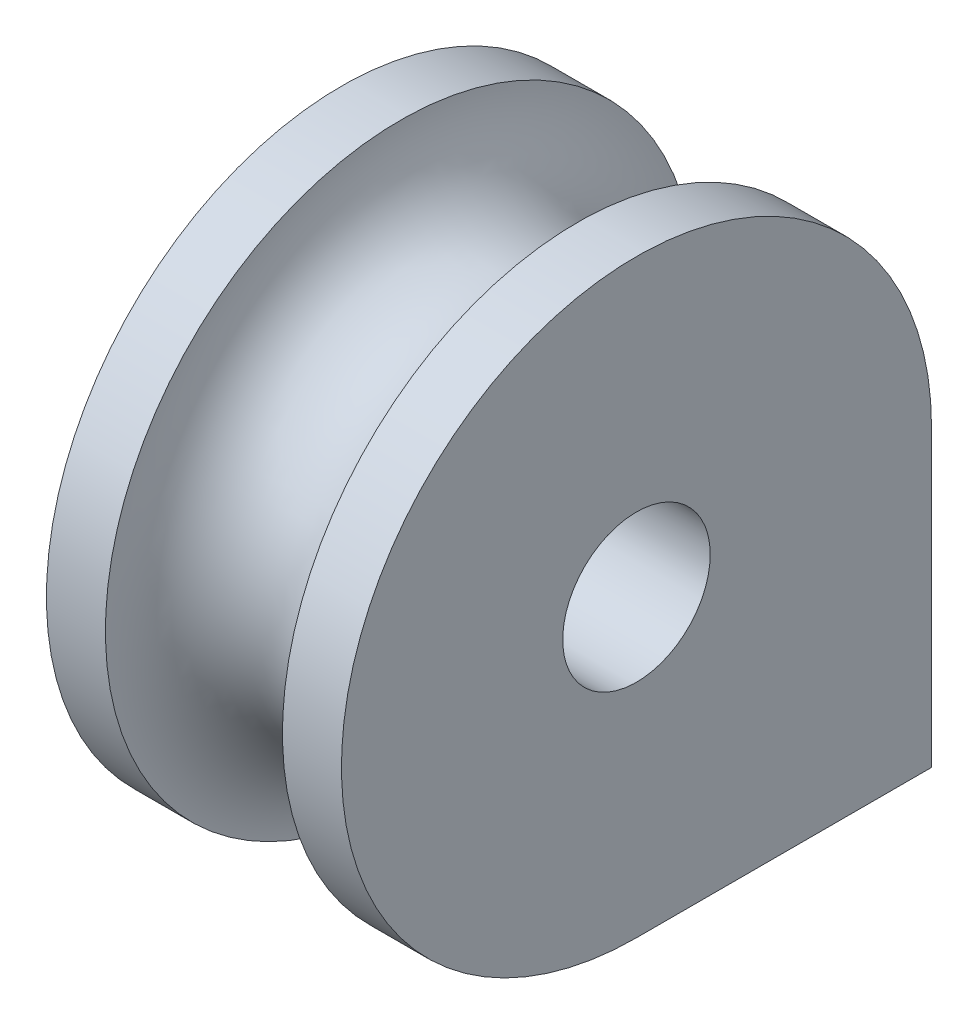
ISO-10303-21;
HEADER;
FILE_DESCRIPTION(('STEP AP214'),'2;1');
FILE_NAME('part.step','',(''),(''),'','','');
FILE_SCHEMA(('AUTOMOTIVE_DESIGN { 1 0 10303 214 1 1 1 1 }'));
ENDSEC;
DATA;
#1=APPLICATION_CONTEXT('core data for automotive mechanical design processes');
#2=APPLICATION_PROTOCOL_DEFINITION('international standard','automotive_design',2000,#1);
#3=PRODUCT_CONTEXT('',#1,'mechanical');
#4=PRODUCT('Part','Part','',(#3));
#5=PRODUCT_RELATED_PRODUCT_CATEGORY('part','',(#4));
#6=PRODUCT_DEFINITION_FORMATION('','',#4);
#7=PRODUCT_DEFINITION_CONTEXT('part definition',#1,'design');
#8=PRODUCT_DEFINITION('design','',#6,#7);
#9=PRODUCT_DEFINITION_SHAPE('','',#8);
#10=(LENGTH_UNIT() NAMED_UNIT(*) SI_UNIT(.MILLI.,.METRE.));
#11=(NAMED_UNIT(*) PLANE_ANGLE_UNIT() SI_UNIT($,.RADIAN.));
#12=(NAMED_UNIT(*) SI_UNIT($,.STERADIAN.) SOLID_ANGLE_UNIT());
#13=UNCERTAINTY_MEASURE_WITH_UNIT(LENGTH_MEASURE(1.E-05),#10,'distance_accuracy_value','');
#14=(GEOMETRIC_REPRESENTATION_CONTEXT(3) GLOBAL_UNCERTAINTY_ASSIGNED_CONTEXT((#13)) GLOBAL_UNIT_ASSIGNED_CONTEXT((#10,
#11,#12)) REPRESENTATION_CONTEXT('',''));
#15=CARTESIAN_POINT('',(0.,0.,0.));
#16=DIRECTION('',(0.,0.,1.));
#17=DIRECTION('',(1.,0.,0.));
#18=AXIS2_PLACEMENT_3D('',#15,#16,#17);
#19=CARTESIAN_POINT('',(-25.,-50.,0.));
#20=DIRECTION('',(0.,0.,1.));
#21=DIRECTION('',(1.,0.,0.));
#22=AXIS2_PLACEMENT_3D('',#19,#20,#21);
#23=PLANE('',#22);
#24=CARTESIAN_POINT('',(0.,-50.,-5.26783817824338E-13));
#25=DIRECTION('',(0.,0.,1.));
#26=DIRECTION('',(0.,1.,0.));
#27=AXIS2_PLACEMENT_3D('',#24,#25,#26);
#28=CIRCLE('',#27,15.);
#29=CARTESIAN_POINT('',(15.,-50.,0.));
#30=VERTEX_POINT('',#29);
#31=CARTESIAN_POINT('',(-15.,-50.,0.));
#32=VERTEX_POINT('',#31);
#33=EDGE_CURVE('E158',#30,#32,#28,.T.);
#34=ORIENTED_EDGE('',*,*,#33,.T.);
#35=DIRECTION('',(1.,0.,0.));
#36=VECTOR('',#35,1.);
#37=CARTESIAN_POINT('',(-25.,-50.,0.));
#38=LINE('',#37,#36);
#39=EDGE_CURVE('E109',#32,#30,#38,.T.);
#40=ORIENTED_EDGE('',*,*,#39,.T.);
#41=EDGE_LOOP('',(#34,#40));
#42=FACE_BOUND('',#41,.T.);
#43=ADVANCED_FACE('F43',(#42),#23,.T.);
#44=CARTESIAN_POINT('',(-25.,-50.,-50.));
#45=DIRECTION('',(0.,0.,-1.));
#46=DIRECTION('',(-1.,0.,0.));
#47=AXIS2_PLACEMENT_3D('',#44,#45,#46);
#48=PLANE('',#47);
#49=DIRECTION('',(-1.,0.,0.));
#50=VECTOR('',#49,1.);
#51=CARTESIAN_POINT('',(-25.,0.,-50.));
#52=LINE('',#51,#50);
#53=CARTESIAN_POINT('',(-15.,0.,-50.));
#54=VERTEX_POINT('',#53);
#55=CARTESIAN_POINT('',(-25.,0.,-50.));
#56=VERTEX_POINT('',#55);
#57=EDGE_CURVE('E152',#54,#56,#52,.T.);
#58=ORIENTED_EDGE('',*,*,#57,.F.);
#59=DIRECTION('',(0.,1.,0.));
#60=VECTOR('',#59,1.);
#61=CARTESIAN_POINT('',(-15.,-50.,-50.));
#62=LINE('',#61,#60);
#63=CARTESIAN_POINT('',(-15.,-50.,-50.));
#64=VERTEX_POINT('',#63);
#65=EDGE_CURVE('E143',#64,#54,#62,.T.);
#66=ORIENTED_EDGE('',*,*,#65,.F.);
#67=DIRECTION('',(-1.,0.,0.));
#68=VECTOR('',#67,1.);
#69=CARTESIAN_POINT('',(-25.,-50.,-50.));
#70=LINE('',#69,#68);
#71=CARTESIAN_POINT('',(-25.,-50.,-50.));
#72=VERTEX_POINT('',#71);
#73=EDGE_CURVE('E131',#64,#72,#70,.T.);
#74=ORIENTED_EDGE('',*,*,#73,.T.);
#75=DIRECTION('',(0.,1.,0.));
#76=VECTOR('',#75,1.);
#77=CARTESIAN_POINT('',(-25.,-50.,-50.));
#78=LINE('',#77,#76);
#79=EDGE_CURVE('E140',#72,#56,#78,.T.);
#80=ORIENTED_EDGE('',*,*,#79,.T.);
#81=EDGE_LOOP('',(#58,#66,#74,#80));
#82=FACE_BOUND('',#81,.T.);
#83=ADVANCED_FACE('F189',(#82),#48,.T.);
#84=CARTESIAN_POINT('',(0.,-50.,-50.));
#85=DIRECTION('',(0.,1.,0.));
#86=DIRECTION('',(0.,0.,1.));
#87=AXIS2_PLACEMENT_3D('',#84,#85,#86);
#88=CYLINDRICAL_SURFACE('',#87,15.);
#89=CARTESIAN_POINT('',(0.,0.,-50.));
#90=DIRECTION('',(0.,-1.,0.));
#91=DIRECTION('',(0.,0.,1.));
#92=AXIS2_PLACEMENT_3D('',#89,#90,#91);
#93=CIRCLE('',#92,15.);
#94=CARTESIAN_POINT('',(15.,0.,-50.));
#95=VERTEX_POINT('',#94);
#96=EDGE_CURVE('E59',#95,#54,#93,.T.);
#97=ORIENTED_EDGE('',*,*,#96,.F.);
#98=DIRECTION('',(0.,1.,0.));
#99=VECTOR('',#98,1.);
#100=CARTESIAN_POINT('',(15.,-50.,-50.));
#101=LINE('',#100,#99);
#102=CARTESIAN_POINT('',(15.,-50.,-50.));
#103=VERTEX_POINT('',#102);
#104=EDGE_CURVE('E108',#103,#95,#101,.T.);
#105=ORIENTED_EDGE('',*,*,#104,.F.);
#106=CARTESIAN_POINT('',(0.,-50.,-50.));
#107=DIRECTION('',(0.,-1.,0.));
#108=DIRECTION('',(0.,0.,1.));
#109=AXIS2_PLACEMENT_3D('',#106,#107,#108);
#110=CIRCLE('',#109,15.);
#111=EDGE_CURVE('E116',#103,#64,#110,.T.);
#112=ORIENTED_EDGE('',*,*,#111,.T.);
#113=ORIENTED_EDGE('',*,*,#65,.T.);
#114=EDGE_LOOP('',(#97,#105,#112,#113));
#115=FACE_BOUND('',#114,.T.);
#116=ADVANCED_FACE('F195',(#115),#88,.F.);
#117=CARTESIAN_POINT('',(15.,-50.,-50.));
#118=DIRECTION('',(0.,0.,-1.));
#119=DIRECTION('',(-1.,0.,0.));
#120=AXIS2_PLACEMENT_3D('',#117,#118,#119);
#121=PLANE('',#120);
#122=DIRECTION('',(-1.,0.,0.));
#123=VECTOR('',#122,1.);
#124=CARTESIAN_POINT('',(15.,0.,-50.));
#125=LINE('',#124,#123);
#126=CARTESIAN_POINT('',(25.,0.,-50.));
#127=VERTEX_POINT('',#126);
#128=EDGE_CURVE('E103',#127,#95,#125,.T.);
#129=ORIENTED_EDGE('',*,*,#128,.F.);
#130=DIRECTION('',(0.,1.,0.));
#131=VECTOR('',#130,1.);
#132=CARTESIAN_POINT('',(25.,-50.,-50.));
#133=LINE('',#132,#131);
#134=CARTESIAN_POINT('',(25.,-50.,-50.));
#135=VERTEX_POINT('',#134);
#136=EDGE_CURVE('E98',#135,#127,#133,.T.);
#137=ORIENTED_EDGE('',*,*,#136,.F.);
#138=DIRECTION('',(-1.,0.,0.));
#139=VECTOR('',#138,1.);
#140=CARTESIAN_POINT('',(15.,-50.,-50.));
#141=LINE('',#140,#139);
#142=EDGE_CURVE('E101',#135,#103,#141,.T.);
#143=ORIENTED_EDGE('',*,*,#142,.T.);
#144=ORIENTED_EDGE('',*,*,#104,.T.);
#145=EDGE_LOOP('',(#129,#137,#143,#144));
#146=FACE_BOUND('',#145,.T.);
#147=ADVANCED_FACE('F100',(#146),#121,.T.);
#148=CARTESIAN_POINT('',(0.,-50.,-50.));
#149=DIRECTION('',(0.,1.,0.));
#150=DIRECTION('',(0.,0.,1.));
#151=AXIS2_PLACEMENT_3D('',#148,#149,#150);
#152=PLANE('',#151);
#153=DIRECTION('',(0.,0.,-1.));
#154=VECTOR('',#153,1.);
#155=CARTESIAN_POINT('',(25.,-50.,0.));
#156=LINE('',#155,#154);
#157=CARTESIAN_POINT('',(25.,-50.,0.));
#158=VERTEX_POINT('',#157);
#159=EDGE_CURVE('E113',#158,#135,#156,.T.);
#160=ORIENTED_EDGE('',*,*,#159,.F.);
#161=DIRECTION('',(-1.,0.,0.));
#162=VECTOR('',#161,1.);
#163=CARTESIAN_POINT('',(15.,-50.,-5.28620788023059E-13));
#164=LINE('',#163,#162);
#165=EDGE_CURVE('E67',#158,#30,#164,.T.);
#166=ORIENTED_EDGE('',*,*,#165,.T.);
#167=ORIENTED_EDGE('',*,*,#39,.F.);
#168=DIRECTION('',(-1.,0.,0.));
#169=VECTOR('',#168,1.);
#170=CARTESIAN_POINT('',(-25.,-50.,-5.2372220082647E-13));
#171=LINE('',#170,#169);
#172=CARTESIAN_POINT('',(-25.,-50.,0.));
#173=VERTEX_POINT('',#172);
#174=EDGE_CURVE('E161',#32,#173,#171,.T.);
#175=ORIENTED_EDGE('',*,*,#174,.T.);
#176=DIRECTION('',(0.,0.,1.));
#177=VECTOR('',#176,1.);
#178=CARTESIAN_POINT('',(-25.,-50.,0.));
#179=LINE('',#178,#177);
#180=EDGE_CURVE('E135',#72,#173,#179,.T.);
#181=ORIENTED_EDGE('',*,*,#180,.F.);
#182=ORIENTED_EDGE('',*,*,#73,.F.);
#183=ORIENTED_EDGE('',*,*,#111,.F.);
#184=ORIENTED_EDGE('',*,*,#142,.F.);
#185=EDGE_LOOP('',(#160,#166,#167,#175,#181,#182,#183,#184));
#186=FACE_BOUND('',#185,.T.);
#187=ADVANCED_FACE('F112',(#186),#152,.F.);
#188=CARTESIAN_POINT('',(25.,0.,0.));
#189=DIRECTION('',(-1.,0.,0.));
#190=DIRECTION('',(0.,0.,1.));
#191=AXIS2_PLACEMENT_3D('',#188,#189,#190);
#192=PLANE('',#191);
#193=CARTESIAN_POINT('',(25.,0.,0.));
#194=DIRECTION('',(1.,0.,0.));
#195=DIRECTION('',(0.,0.,-1.));
#196=AXIS2_PLACEMENT_3D('',#193,#194,#195);
#197=CIRCLE('',#196,12.5);
#198=CARTESIAN_POINT('',(25.,0.,-12.5));
#199=VERTEX_POINT('',#198);
#200=EDGE_CURVE('E125',#199,#199,#197,.T.);
#201=ORIENTED_EDGE('',*,*,#200,.F.);
#202=EDGE_LOOP('',(#201));
#203=FACE_BOUND('',#202,.T.);
#204=CARTESIAN_POINT('',(25.,0.,0.));
#205=DIRECTION('',(-1.,0.,0.));
#206=DIRECTION('',(0.,0.,1.));
#207=AXIS2_PLACEMENT_3D('',#204,#205,#206);
#208=CIRCLE('',#207,50.);
#209=EDGE_CURVE('E11',#158,#127,#208,.T.);
#210=ORIENTED_EDGE('',*,*,#209,.F.);
#211=ORIENTED_EDGE('',*,*,#159,.T.);
#212=ORIENTED_EDGE('',*,*,#136,.T.);
#213=EDGE_LOOP('',(#210,#211,#212));
#214=FACE_BOUND('',#213,.T.);
#215=ADVANCED_FACE('F119',(#203,#214),#192,.F.);
#216=CARTESIAN_POINT('',(-25.,0.,0.));
#217=DIRECTION('',(-1.,0.,0.));
#218=DIRECTION('',(0.,0.,1.));
#219=AXIS2_PLACEMENT_3D('',#216,#217,#218);
#220=CYLINDRICAL_SURFACE('',#219,50.);
#221=CARTESIAN_POINT('',(15.,0.,0.));
#222=DIRECTION('',(-1.,0.,0.));
#223=DIRECTION('',(0.,0.,1.));
#224=AXIS2_PLACEMENT_3D('',#221,#222,#223);
#225=CIRCLE('',#224,50.);
#226=EDGE_CURVE('E52',#30,#95,#225,.T.);
#227=ORIENTED_EDGE('',*,*,#226,.F.);
#228=ORIENTED_EDGE('',*,*,#165,.F.);
#229=ORIENTED_EDGE('',*,*,#209,.T.);
#230=ORIENTED_EDGE('',*,*,#128,.T.);
#231=EDGE_LOOP('',(#227,#228,#229,#230));
#232=FACE_BOUND('',#231,.T.);
#233=ADVANCED_FACE('F45',(#232),#220,.T.);
#234=CARTESIAN_POINT('',(0.,0.,0.));
#235=DIRECTION('',(-1.,0.,0.));
#236=DIRECTION('',(0.,0.,1.));
#237=AXIS2_PLACEMENT_3D('',#234,#235,#236);
#238=TOROIDAL_SURFACE('',#237,50.,15.);
#239=CARTESIAN_POINT('',(-15.,0.,0.));
#240=DIRECTION('',(-1.,0.,0.));
#241=DIRECTION('',(0.,0.,1.));
#242=AXIS2_PLACEMENT_3D('',#239,#240,#241);
#243=CIRCLE('',#242,50.);
#244=EDGE_CURVE('E169',#32,#54,#243,.T.);
#245=ORIENTED_EDGE('',*,*,#244,.F.);
#246=ORIENTED_EDGE('',*,*,#33,.F.);
#247=ORIENTED_EDGE('',*,*,#226,.T.);
#248=ORIENTED_EDGE('',*,*,#96,.T.);
#249=EDGE_LOOP('',(#245,#246,#247,#248));
#250=FACE_BOUND('',#249,.T.);
#251=ADVANCED_FACE('F178',(#250),#238,.F.);
#252=CARTESIAN_POINT('',(-25.,0.,0.));
#253=DIRECTION('',(-1.,0.,0.));
#254=DIRECTION('',(0.,0.,1.));
#255=AXIS2_PLACEMENT_3D('',#252,#253,#254);
#256=CYLINDRICAL_SURFACE('',#255,50.);
#257=CARTESIAN_POINT('',(-25.,0.,0.));
#258=DIRECTION('',(-1.,0.,0.));
#259=DIRECTION('',(0.,0.,1.));
#260=AXIS2_PLACEMENT_3D('',#257,#258,#259);
#261=CIRCLE('',#260,50.);
#262=EDGE_CURVE('E165',#173,#56,#261,.T.);
#263=ORIENTED_EDGE('',*,*,#262,.F.);
#264=ORIENTED_EDGE('',*,*,#174,.F.);
#265=ORIENTED_EDGE('',*,*,#244,.T.);
#266=ORIENTED_EDGE('',*,*,#57,.T.);
#267=EDGE_LOOP('',(#263,#264,#265,#266));
#268=FACE_BOUND('',#267,.T.);
#269=ADVANCED_FACE('F185',(#268),#256,.T.);
#270=CARTESIAN_POINT('',(-25.,0.,0.));
#271=DIRECTION('',(1.,0.,0.));
#272=DIRECTION('',(0.,0.,-1.));
#273=AXIS2_PLACEMENT_3D('',#270,#271,#272);
#274=PLANE('',#273);
#275=CARTESIAN_POINT('',(-25.,0.,0.));
#276=DIRECTION('',(1.,0.,0.));
#277=DIRECTION('',(0.,0.,-1.));
#278=AXIS2_PLACEMENT_3D('',#275,#276,#277);
#279=CIRCLE('',#278,12.5);
#280=CARTESIAN_POINT('',(-25.,0.,-12.5));
#281=VERTEX_POINT('',#280);
#282=EDGE_CURVE('E121',#281,#281,#279,.T.);
#283=ORIENTED_EDGE('',*,*,#282,.T.);
#284=EDGE_LOOP('',(#283));
#285=FACE_BOUND('',#284,.T.);
#286=ORIENTED_EDGE('',*,*,#262,.T.);
#287=ORIENTED_EDGE('',*,*,#79,.F.);
#288=ORIENTED_EDGE('',*,*,#180,.T.);
#289=EDGE_LOOP('',(#286,#287,#288));
#290=FACE_BOUND('',#289,.T.);
#291=ADVANCED_FACE('F205',(#285,#290),#274,.F.);
#292=CARTESIAN_POINT('',(-25.,0.,0.));
#293=DIRECTION('',(1.,0.,0.));
#294=DIRECTION('',(0.,0.,-1.));
#295=AXIS2_PLACEMENT_3D('',#292,#293,#294);
#296=CYLINDRICAL_SURFACE('',#295,12.5);
#297=ORIENTED_EDGE('',*,*,#282,.F.);
#298=EDGE_LOOP('',(#297));
#299=FACE_BOUND('',#298,.T.);
#300=ORIENTED_EDGE('',*,*,#200,.T.);
#301=EDGE_LOOP('',(#300));
#302=FACE_BOUND('',#301,.T.);
#303=ADVANCED_FACE('F208',(#299,#302),#296,.F.);
#304=CLOSED_SHELL('',(#43,#83,#116,#147,#187,#215,#233,#251,#269,#291,#303));
#305=MANIFOLD_SOLID_BREP('B2',#304);
#306=ADVANCED_BREP_SHAPE_REPRESENTATION('',(#18,#305),#14);
#307=SHAPE_DEFINITION_REPRESENTATION(#9,#306);
ENDSEC;
END-ISO-10303-21;
